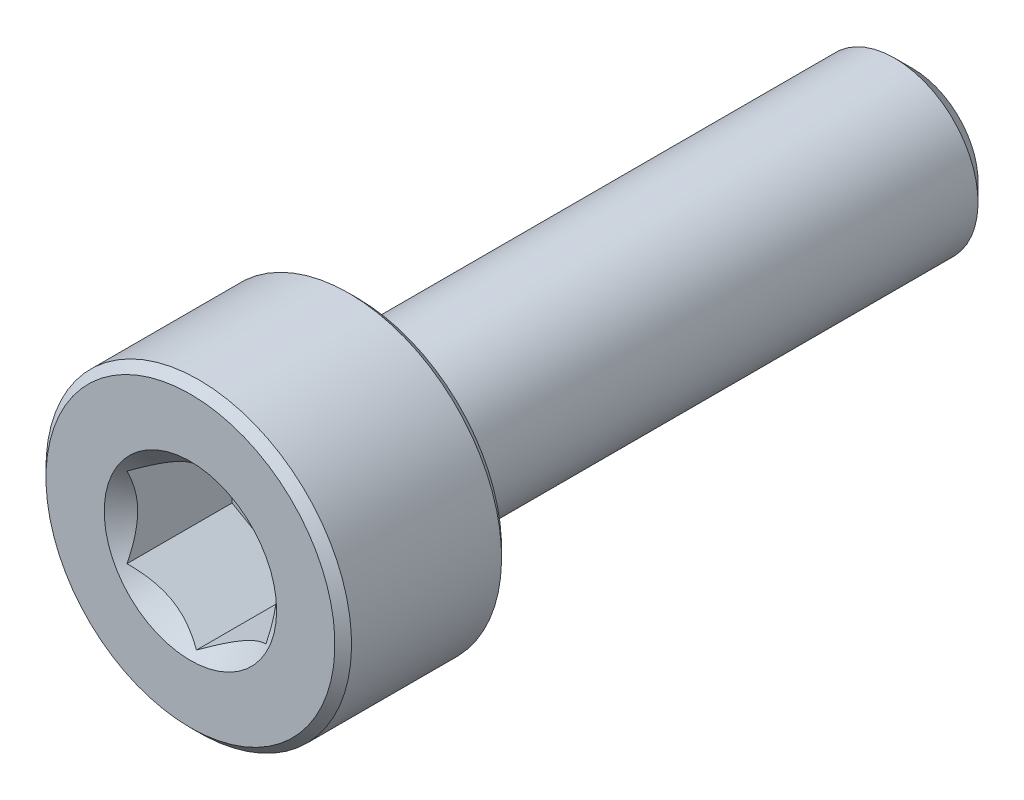
ISO-10303-21;
HEADER;
FILE_DESCRIPTION(('STEP AP214'),'2;1');
FILE_NAME('part.step','',(''),(''),'','','');
FILE_SCHEMA(('AUTOMOTIVE_DESIGN { 1 0 10303 214 1 1 1 1 }'));
ENDSEC;
DATA;
#1=APPLICATION_CONTEXT('core data for automotive mechanical design processes');
#2=APPLICATION_PROTOCOL_DEFINITION('international standard','automotive_design',2000,#1);
#3=PRODUCT_CONTEXT('',#1,'mechanical');
#4=PRODUCT('Part','Part','',(#3));
#5=PRODUCT_RELATED_PRODUCT_CATEGORY('part','',(#4));
#6=PRODUCT_DEFINITION_FORMATION('','',#4);
#7=PRODUCT_DEFINITION_CONTEXT('part definition',#1,'design');
#8=PRODUCT_DEFINITION('design','',#6,#7);
#9=PRODUCT_DEFINITION_SHAPE('','',#8);
#10=(LENGTH_UNIT() NAMED_UNIT(*) SI_UNIT(.MILLI.,.METRE.));
#11=(NAMED_UNIT(*) PLANE_ANGLE_UNIT() SI_UNIT($,.RADIAN.));
#12=(NAMED_UNIT(*) SI_UNIT($,.STERADIAN.) SOLID_ANGLE_UNIT());
#13=UNCERTAINTY_MEASURE_WITH_UNIT(LENGTH_MEASURE(1.E-05),#10,'distance_accuracy_value','');
#14=(GEOMETRIC_REPRESENTATION_CONTEXT(3) GLOBAL_UNCERTAINTY_ASSIGNED_CONTEXT((#13)) GLOBAL_UNIT_ASSIGNED_CONTEXT((#10,
#11,#12)) REPRESENTATION_CONTEXT('',''));
#15=CARTESIAN_POINT('',(0.,0.,0.));
#16=DIRECTION('',(0.,0.,1.));
#17=DIRECTION('',(1.,0.,0.));
#18=AXIS2_PLACEMENT_3D('',#15,#16,#17);
#19=CARTESIAN_POINT('',(0.,0.,3.35));
#20=DIRECTION('',(0.,0.,-1.));
#21=DIRECTION('',(0.,1.,0.));
#22=AXIS2_PLACEMENT_3D('',#19,#20,#21);
#23=TOROIDAL_SURFACE('',#22,1.65,0.15);
#24=CARTESIAN_POINT('',(0.,0.,3.5));
#25=DIRECTION('',(0.,0.,-1.));
#26=DIRECTION('',(0.,1.,0.));
#27=AXIS2_PLACEMENT_3D('',#24,#25,#26);
#28=CIRCLE('',#27,1.65);
#29=CARTESIAN_POINT('',(0.,1.65,3.5));
#30=VERTEX_POINT('',#29);
#31=EDGE_CURVE('E245',#30,#30,#28,.T.);
#32=ORIENTED_EDGE('',*,*,#31,.T.);
#33=EDGE_LOOP('',(#32));
#34=FACE_BOUND('',#33,.T.);
#35=CARTESIAN_POINT('',(0.,0.,3.35));
#36=DIRECTION('',(0.,0.,-1.));
#37=DIRECTION('',(0.,1.,0.));
#38=AXIS2_PLACEMENT_3D('',#35,#36,#37);
#39=CIRCLE('',#38,1.5);
#40=CARTESIAN_POINT('',(0.,1.5,3.35));
#41=VERTEX_POINT('',#40);
#42=EDGE_CURVE('E53',#41,#41,#39,.T.);
#43=ORIENTED_EDGE('',*,*,#42,.F.);
#44=EDGE_LOOP('',(#43));
#45=FACE_BOUND('',#44,.T.);
#46=ADVANCED_FACE('F48',(#34,#45),#23,.F.);
#47=CARTESIAN_POINT('',(0.,2.6,3.5));
#48=DIRECTION('',(0.,0.,-1.));
#49=DIRECTION('',(0.,1.,0.));
#50=AXIS2_PLACEMENT_3D('',#47,#48,#49);
#51=PLANE('',#50);
#52=CARTESIAN_POINT('',(0.,0.,3.5));
#53=DIRECTION('',(0.,0.,-1.));
#54=DIRECTION('',(0.,1.,0.));
#55=AXIS2_PLACEMENT_3D('',#52,#53,#54);
#56=CIRCLE('',#55,2.6);
#57=CARTESIAN_POINT('',(0.,2.6,3.5));
#58=VERTEX_POINT('',#57);
#59=EDGE_CURVE('E247',#58,#58,#56,.T.);
#60=ORIENTED_EDGE('',*,*,#59,.T.);
#61=EDGE_LOOP('',(#60));
#62=FACE_BOUND('',#61,.T.);
#63=ORIENTED_EDGE('',*,*,#31,.F.);
#64=EDGE_LOOP('',(#63));
#65=FACE_BOUND('',#64,.T.);
#66=ADVANCED_FACE('F115',(#62,#65),#51,.T.);
#67=CARTESIAN_POINT('',(0.,0.,3.5));
#68=DIRECTION('',(0.,0.,1.));
#69=DIRECTION('',(0.,-1.,0.));
#70=AXIS2_PLACEMENT_3D('',#67,#68,#69);
#71=CONICAL_SURFACE('',#70,2.6,0.785398163397445);
#72=CARTESIAN_POINT('',(0.,0.,3.65));
#73=DIRECTION('',(0.,0.,-1.));
#74=DIRECTION('',(0.,1.,0.));
#75=AXIS2_PLACEMENT_3D('',#72,#73,#74);
#76=CIRCLE('',#75,2.75);
#77=CARTESIAN_POINT('',(0.,2.75,3.65));
#78=VERTEX_POINT('',#77);
#79=EDGE_CURVE('E256',#78,#78,#76,.T.);
#80=ORIENTED_EDGE('',*,*,#79,.T.);
#81=EDGE_LOOP('',(#80));
#82=FACE_BOUND('',#81,.T.);
#83=ORIENTED_EDGE('',*,*,#59,.F.);
#84=EDGE_LOOP('',(#83));
#85=FACE_BOUND('',#84,.T.);
#86=ADVANCED_FACE('F120',(#82,#85),#71,.T.);
#87=CARTESIAN_POINT('',(0.,0.,-6.5));
#88=DIRECTION('',(0.,0.,-1.));
#89=DIRECTION('',(0.,1.,0.));
#90=AXIS2_PLACEMENT_3D('',#87,#88,#89);
#91=CYLINDRICAL_SURFACE('',#90,2.75);
#92=CARTESIAN_POINT('',(0.,0.,6.35));
#93=DIRECTION('',(0.,0.,-1.));
#94=DIRECTION('',(0.,1.,0.));
#95=AXIS2_PLACEMENT_3D('',#92,#93,#94);
#96=CIRCLE('',#95,2.75);
#97=CARTESIAN_POINT('',(0.,2.75,6.35));
#98=VERTEX_POINT('',#97);
#99=EDGE_CURVE('E235',#98,#98,#96,.T.);
#100=ORIENTED_EDGE('',*,*,#99,.T.);
#101=EDGE_LOOP('',(#100));
#102=FACE_BOUND('',#101,.T.);
#103=ORIENTED_EDGE('',*,*,#79,.F.);
#104=EDGE_LOOP('',(#103));
#105=FACE_BOUND('',#104,.T.);
#106=ADVANCED_FACE('F128',(#102,#105),#91,.T.);
#107=CARTESIAN_POINT('',(0.,0.,6.35));
#108=DIRECTION('',(0.,0.,-1.));
#109=DIRECTION('',(0.,1.,0.));
#110=AXIS2_PLACEMENT_3D('',#107,#108,#109);
#111=CONICAL_SURFACE('',#110,2.75,0.785398163397451);
#112=CARTESIAN_POINT('',(0.,0.,6.5));
#113=DIRECTION('',(0.,0.,-1.));
#114=DIRECTION('',(0.,1.,0.));
#115=AXIS2_PLACEMENT_3D('',#112,#113,#114);
#116=CIRCLE('',#115,2.6);
#117=CARTESIAN_POINT('',(0.,2.6,6.5));
#118=VERTEX_POINT('',#117);
#119=EDGE_CURVE('E232',#118,#118,#116,.T.);
#120=ORIENTED_EDGE('',*,*,#119,.T.);
#121=EDGE_LOOP('',(#120));
#122=FACE_BOUND('',#121,.T.);
#123=ORIENTED_EDGE('',*,*,#99,.F.);
#124=EDGE_LOOP('',(#123));
#125=FACE_BOUND('',#124,.T.);
#126=ADVANCED_FACE('F132',(#122,#125),#111,.T.);
#127=CARTESIAN_POINT('',(0.,0.,6.5));
#128=DIRECTION('',(0.,0.,1.));
#129=DIRECTION('',(0.,-1.,0.));
#130=AXIS2_PLACEMENT_3D('',#127,#128,#129);
#131=PLANE('',#130);
#132=CARTESIAN_POINT('',(0.,0.,6.5));
#133=DIRECTION('',(0.,0.,1.));
#134=DIRECTION('',(1.,0.,0.));
#135=AXIS2_PLACEMENT_3D('',#132,#133,#134);
#136=CIRCLE('',#135,1.55162884844712);
#137=CARTESIAN_POINT('',(1.55162884844712,0.,6.5));
#138=VERTEX_POINT('',#137);
#139=EDGE_CURVE('E12',#138,#138,#136,.T.);
#140=ORIENTED_EDGE('',*,*,#139,.F.);
#141=EDGE_LOOP('',(#140));
#142=FACE_BOUND('',#141,.T.);
#143=ORIENTED_EDGE('',*,*,#119,.F.);
#144=EDGE_LOOP('',(#143));
#145=FACE_BOUND('',#144,.T.);
#146=ADVANCED_FACE('F136',(#142,#145),#131,.T.);
#147=CARTESIAN_POINT('',(0.,0.,6.5));
#148=DIRECTION('',(0.,0.,1.));
#149=DIRECTION('',(1.,0.,0.));
#150=AXIS2_PLACEMENT_3D('',#147,#148,#149);
#151=CONICAL_SURFACE('',#150,1.55162884844712,0.78539816339745);
#152=ORIENTED_EDGE('',*,*,#139,.T.);
#153=EDGE_LOOP('',(#152));
#154=FACE_BOUND('',#153,.T.);
#155=CARTESIAN_POINT('',(-0.000199999999999347,-1.4434911430279,6.39186230843608));
#156=CARTESIAN_POINT('',(0.0427751670715874,-1.41867941875065,6.36706849258205));
#157=CARTESIAN_POINT('',(0.0864690047459488,-1.39345276980743,6.34373055894563));
#158=CARTESIAN_POINT('',(0.175565930841943,-1.34201263554194,6.30099882861148));
#159=CARTESIAN_POINT('',(0.220977498357065,-1.31579425481276,6.28162881688736));
#160=CARTESIAN_POINT('',(0.312547820935261,-1.26292610442246,6.24844730794042));
#161=CARTESIAN_POINT('',(0.358683240175886,-1.23628980770471,6.2345523835796));
#162=CARTESIAN_POINT('',(0.451970080407593,-1.18243062538508,6.21314410668758));
#163=CARTESIAN_POINT('',(0.499118649136381,-1.15520938653761,6.20561476609373));
#164=CARTESIAN_POINT('',(0.580373556887253,-1.10829684367467,6.19882132257765));
#165=CARTESIAN_POINT('',(0.614374876627942,-1.08866617256958,6.1978153836313));
#166=CARTESIAN_POINT('',(0.682317764432479,-1.04943932800611,6.19950823943826));
#167=CARTESIAN_POINT('',(0.716259317655659,-1.02984316311599,6.20220785174248));
#168=CARTESIAN_POINT('',(0.783814856457501,-0.990839954603499,6.21115575484332));
#169=CARTESIAN_POINT('',(0.817428507286776,-0.971433104248771,6.21740735042665));
#170=CARTESIAN_POINT('',(0.884094638217814,-0.932943395609905,6.23312250594085));
#171=CARTESIAN_POINT('',(0.917146871030297,-0.9138606800983,6.2425874446144));
#172=CARTESIAN_POINT('',(1.00179969160027,-0.864986351354567,6.27067821521453));
#173=CARTESIAN_POINT('',(1.05286649242964,-0.835502920149075,6.29141698197915));
#174=CARTESIAN_POINT('',(1.15300085411326,-0.777690319475908,6.33813395919842));
#175=CARTESIAN_POINT('',(1.20207431157827,-0.749357745598417,6.36409512047371));
#176=CARTESIAN_POINT('',(1.2502,-0.721572366433194,6.39186230843608));
#177=B_SPLINE_CURVE_WITH_KNOTS('',3,(#155,#156,#157,#158,#159,#160,#161,#162,#163,#164,#165,
#166,#167,#168,#169,#170,#171,#172,#173,#174,#175,#176),.UNSPECIFIED.,.F.,.F.,(4,2,2,2,2,2,2,2,
2,2,4),(0.,0.166533409618304,0.334037607289762,0.498880396489698,0.663307919240275,
0.780963963458827,0.898645970148454,1.01643764860773,1.1342799317155,1.32148652032141,
1.50809158792573),.UNSPECIFIED.);
#178=CARTESIAN_POINT('',(0.,-1.44337567297406,6.39174682452695));
#179=VERTEX_POINT('',#178);
#180=CARTESIAN_POINT('',(1.25,-0.721687836487032,6.39174682452694));
#181=VERTEX_POINT('',#180);
#182=EDGE_CURVE('E65',#179,#181,#177,.T.);
#183=ORIENTED_EDGE('',*,*,#182,.F.);
#184=CARTESIAN_POINT('',(-1.2502,-0.721572366433195,6.39186230843608));
#185=CARTESIAN_POINT('',(-1.20722483292841,-0.746384090710444,6.36706849258205));
#186=CARTESIAN_POINT('',(-1.16353099525405,-0.771610739653664,6.34373055894563));
#187=CARTESIAN_POINT('',(-1.07443406915806,-0.823050873919155,6.30099882861148));
#188=CARTESIAN_POINT('',(-1.02902250164294,-0.849269254648333,6.28162881688736));
#189=CARTESIAN_POINT('',(-0.93745217906474,-0.902137405038635,6.24844730794042));
#190=CARTESIAN_POINT('',(-0.891316759824114,-0.928773701756387,6.2345523835796));
#191=CARTESIAN_POINT('',(-0.798029919592408,-0.982632884076012,6.21314410668758));
#192=CARTESIAN_POINT('',(-0.75088135086362,-1.00985412292348,6.20561476609373));
#193=CARTESIAN_POINT('',(-0.669626443112748,-1.05676666578643,6.19882132257765));
#194=CARTESIAN_POINT('',(-0.635625123372059,-1.07639733689152,6.1978153836313));
#195=CARTESIAN_POINT('',(-0.567682235567523,-1.11562418145499,6.19950823943826));
#196=CARTESIAN_POINT('',(-0.533740682344343,-1.1352203463451,6.20220785174248));
#197=CARTESIAN_POINT('',(-0.466185143542501,-1.1742235548576,6.21115575484332));
#198=CARTESIAN_POINT('',(-0.432571492713225,-1.19363040521233,6.21740735042665));
#199=CARTESIAN_POINT('',(-0.365905361782187,-1.23212011385119,6.23312250594085));
#200=CARTESIAN_POINT('',(-0.332853128969705,-1.2512028293628,6.2425874446144));
#201=CARTESIAN_POINT('',(-0.248200308399736,-1.30007715810653,6.27067821521453));
#202=CARTESIAN_POINT('',(-0.197133507570362,-1.32956058931202,6.29141698197915));
#203=CARTESIAN_POINT('',(-0.0969991458867446,-1.38737318998519,6.33813395919842));
#204=CARTESIAN_POINT('',(-0.0479256884217298,-1.41570576386268,6.36409512047371));
#205=CARTESIAN_POINT('',(0.000200000000000719,-1.4434911430279,6.39186230843608));
#206=B_SPLINE_CURVE_WITH_KNOTS('',3,(#184,#185,#186,#187,#188,#189,#190,#191,#192,#193,#194,
#195,#196,#197,#198,#199,#200,#201,#202,#203,#204,#205),.UNSPECIFIED.,.F.,.F.,(4,2,2,2,2,2,2,2,
2,2,4),(0.,0.166533409618303,0.334037607289761,0.498880396489698,0.663307919240274,
0.780963963458826,0.898645970148452,1.01643764860773,1.13427993171549,1.32148652032141,
1.50809158792574),.UNSPECIFIED.);
#207=CARTESIAN_POINT('',(-1.25,-0.721687836487032,6.39174682452694));
#208=VERTEX_POINT('',#207);
#209=EDGE_CURVE('E58',#208,#179,#206,.T.);
#210=ORIENTED_EDGE('',*,*,#209,.F.);
#211=CARTESIAN_POINT('',(-1.25,-1.52022146239345,6.91651070319084));
#212=CARTESIAN_POINT('',(-1.25,-1.48354689134962,6.88818689718723));
#213=CARTESIAN_POINT('',(-1.25,-1.44667707589305,6.86011672093047));
#214=CARTESIAN_POINT('',(-1.25,-1.37246477804769,6.80459065501776));
#215=CARTESIAN_POINT('',(-1.25,-1.33512218721453,6.77713491044787));
#216=CARTESIAN_POINT('',(-1.25,-1.22171630832114,6.69545809771049));
#217=CARTESIAN_POINT('',(-1.25,-1.14482995781092,6.6423614251193));
#218=CARTESIAN_POINT('',(-1.25,-0.983056768942587,6.53734973416941));
#219=CARTESIAN_POINT('',(-1.25,-0.897974111811057,6.48573326925832));
#220=CARTESIAN_POINT('',(-1.25,-0.723462355215556,6.39078355108508));
#221=CARTESIAN_POINT('',(-1.25,-0.634049271919706,6.34742232185916));
#222=CARTESIAN_POINT('',(-1.25,-0.5005887711437,6.29435177040724));
#223=CARTESIAN_POINT('',(-1.25,-0.45869172620811,6.27926501327173));
#224=CARTESIAN_POINT('',(-1.25,-0.373815329706779,6.25244749770266));
#225=CARTESIAN_POINT('',(-1.25,-0.330835910419723,6.24071694982871));
#226=CARTESIAN_POINT('',(-1.25,-0.244810833071148,6.22144313304601));
#227=CARTESIAN_POINT('',(-1.25,-0.20178270746757,6.21382289169453));
#228=CARTESIAN_POINT('',(-1.25,-0.115176247984995,6.20293190707962));
#229=CARTESIAN_POINT('',(-1.25,-0.0715980347745597,6.1996602260857));
#230=CARTESIAN_POINT('',(-1.25,0.0136806197531966,6.19775210045869));
#231=CARTESIAN_POINT('',(-1.25,0.0553765370047047,6.19891205716704));
#232=CARTESIAN_POINT('',(-1.25,0.13844909645316,6.20533266388464));
#233=CARTESIAN_POINT('',(-1.25,0.179825709781942,6.21059368038276));
#234=CARTESIAN_POINT('',(-1.25,0.262662840763598,6.22500574721218));
#235=CARTESIAN_POINT('',(-1.25,0.304111120669651,6.23422600730023));
#236=CARTESIAN_POINT('',(-1.25,0.386089884230834,6.25604235623938));
#237=CARTESIAN_POINT('',(-1.25,0.426620414510369,6.26863827317792));
#238=CARTESIAN_POINT('',(-1.25,0.550794781768362,6.3120595916479));
#239=CARTESIAN_POINT('',(-1.25,0.632755591043412,6.34768282700966));
#240=CARTESIAN_POINT('',(-1.25,0.792852508946382,6.42696814455953));
#241=CARTESIAN_POINT('',(-1.25,0.870973935410876,6.47065844211049));
#242=CARTESIAN_POINT('',(-1.25,1.02031328199646,6.56088158787621));
#243=CARTESIAN_POINT('',(-1.25,1.09168171050215,6.60716845879521));
#244=CARTESIAN_POINT('',(-1.25,1.19682802849918,6.67876149953674));
#245=CARTESIAN_POINT('',(-1.25,1.2314248214359,6.70288582787532));
#246=CARTESIAN_POINT('',(-1.25,1.30014350643268,6.75178258410313));
#247=CARTESIAN_POINT('',(-1.25,1.33426552680451,6.7765548314612));
#248=CARTESIAN_POINT('',(-1.25,1.36818950249276,6.8015960474388));
#249=B_SPLINE_CURVE_WITH_KNOTS('',3,(#211,#212,#213,#214,#215,#216,#217,#218,#219,#220,#221,
#222,#223,#224,#225,#226,#227,#228,#229,#230,#231,#232,#233,#234,#235,#236,#237,#238,#239,#240,
#241,#242,#243,#244,#245,#246,#247,#248),.UNSPECIFIED.,.F.,.F.,(4,2,2,2,2,2,2,2,2,2,2,2,2,2,2,2,
2,2,4),(0.,0.139012369615044,0.278057225136918,0.558259504053771,0.856585057342475,
1.15388088887299,1.28736138903992,1.42085026158167,1.55174393609413,1.68260937990424,
1.80753647715252,1.93247473971975,2.05969207441603,2.18690293152764,2.45422704655832,
2.72250450232039,2.97756898823762,3.10409578574714,3.23058769667827),.UNSPECIFIED.);
#250=CARTESIAN_POINT('',(-1.25,0.721687836487032,6.39174682452694));
#251=VERTEX_POINT('',#250);
#252=EDGE_CURVE('E174',#251,#208,#249,.F.);
#253=ORIENTED_EDGE('',*,*,#252,.F.);
#254=CARTESIAN_POINT('',(0.000199999999999644,1.4434911430279,6.39186230843608));
#255=CARTESIAN_POINT('',(-0.0427751670715868,1.41867941875065,6.36706849258205));
#256=CARTESIAN_POINT('',(-0.0864690047459481,1.39345276980743,6.34373055894563));
#257=CARTESIAN_POINT('',(-0.175565930841942,1.34201263554194,6.30099882861148));
#258=CARTESIAN_POINT('',(-0.220977498357064,1.31579425481276,6.28162881688736));
#259=CARTESIAN_POINT('',(-0.312547820935259,1.26292610442246,6.24844730794042));
#260=CARTESIAN_POINT('',(-0.358683240175885,1.23628980770471,6.2345523835796));
#261=CARTESIAN_POINT('',(-0.451970080407592,1.18243062538508,6.21314410668758));
#262=CARTESIAN_POINT('',(-0.49911864913638,1.15520938653761,6.20561476609373));
#263=CARTESIAN_POINT('',(-0.580373556887252,1.10829684367467,6.19882132257765));
#264=CARTESIAN_POINT('',(-0.614374876627941,1.08866617256958,6.1978153836313));
#265=CARTESIAN_POINT('',(-0.682317764432477,1.04943932800611,6.19950823943826));
#266=CARTESIAN_POINT('',(-0.716259317655657,1.02984316311599,6.20220785174248));
#267=CARTESIAN_POINT('',(-0.783814856457499,0.990839954603499,6.21115575484332));
#268=CARTESIAN_POINT('',(-0.817428507286774,0.971433104248771,6.21740735042665));
#269=CARTESIAN_POINT('',(-0.884094638217813,0.932943395609905,6.23312250594085));
#270=CARTESIAN_POINT('',(-0.917146871030295,0.9138606800983,6.2425874446144));
#271=CARTESIAN_POINT('',(-1.00179969160026,0.864986351354567,6.27067821521453));
#272=CARTESIAN_POINT('',(-1.05286649242964,0.835502920149075,6.29141698197915));
#273=CARTESIAN_POINT('',(-1.15300085411325,0.777690319475908,6.33813395919842));
#274=CARTESIAN_POINT('',(-1.20207431157827,0.749357745598416,6.36409512047371));
#275=CARTESIAN_POINT('',(-1.2502,0.721572366433194,6.39186230843608));
#276=B_SPLINE_CURVE_WITH_KNOTS('',3,(#254,#255,#256,#257,#258,#259,#260,#261,#262,#263,#264,
#265,#266,#267,#268,#269,#270,#271,#272,#273,#274,#275),.UNSPECIFIED.,.F.,.F.,(4,2,2,2,2,2,2,2,
2,2,4),(0.,0.166533409618303,0.334037607289761,0.498880396489697,0.663307919240274,
0.780963963458826,0.898645970148452,1.01643764860773,1.13427993171549,1.32148652032141,
1.50809158792574),.UNSPECIFIED.);
#277=CARTESIAN_POINT('',(0.,1.44337567297406,6.39174682452694));
#278=VERTEX_POINT('',#277);
#279=EDGE_CURVE('E167',#278,#251,#276,.T.);
#280=ORIENTED_EDGE('',*,*,#279,.F.);
#281=CARTESIAN_POINT('',(1.2502,0.721572366433194,6.39186230843608));
#282=CARTESIAN_POINT('',(1.20722483292841,0.746384090710444,6.36706849258205));
#283=CARTESIAN_POINT('',(1.16353099525405,0.771610739653664,6.34373055894563));
#284=CARTESIAN_POINT('',(1.07443406915806,0.823050873919154,6.30099882861148));
#285=CARTESIAN_POINT('',(1.02902250164294,0.849269254648333,6.28162881688736));
#286=CARTESIAN_POINT('',(0.93745217906474,0.902137405038635,6.24844730794042));
#287=CARTESIAN_POINT('',(0.891316759824114,0.928773701756387,6.2345523835796));
#288=CARTESIAN_POINT('',(0.798029919592408,0.982632884076012,6.21314410668758));
#289=CARTESIAN_POINT('',(0.750881350863621,1.00985412292348,6.20561476609373));
#290=CARTESIAN_POINT('',(0.669626443112748,1.05676666578643,6.19882132257765));
#291=CARTESIAN_POINT('',(0.635625123372059,1.07639733689152,6.19781538363129));
#292=CARTESIAN_POINT('',(0.567682235567523,1.11562418145499,6.19950823943826));
#293=CARTESIAN_POINT('',(0.533740682344343,1.1352203463451,6.20220785174248));
#294=CARTESIAN_POINT('',(0.466185143542501,1.1742235548576,6.21115575484332));
#295=CARTESIAN_POINT('',(0.432571492713226,1.19363040521233,6.21740735042665));
#296=CARTESIAN_POINT('',(0.365905361782187,1.23212011385119,6.23312250594085));
#297=CARTESIAN_POINT('',(0.332853128969705,1.2512028293628,6.2425874446144));
#298=CARTESIAN_POINT('',(0.248200308399736,1.30007715810653,6.27067821521453));
#299=CARTESIAN_POINT('',(0.197133507570362,1.32956058931202,6.29141698197915));
#300=CARTESIAN_POINT('',(0.0969991458867456,1.38737318998519,6.33813395919842));
#301=CARTESIAN_POINT('',(0.0479256884217306,1.41570576386268,6.36409512047371));
#302=CARTESIAN_POINT('',(-0.000200000000000208,1.4434911430279,6.39186230843608));
#303=B_SPLINE_CURVE_WITH_KNOTS('',3,(#281,#282,#283,#284,#285,#286,#287,#288,#289,#290,#291,
#292,#293,#294,#295,#296,#297,#298,#299,#300,#301,#302),.UNSPECIFIED.,.F.,.F.,(4,2,2,2,2,2,2,2,
2,2,4),(0.,0.166533409618303,0.334037607289761,0.498880396489698,0.663307919240274,
0.780963963458826,0.898645970148452,1.01643764860773,1.13427993171549,1.32148652032141,
1.50809158792574),.UNSPECIFIED.);
#304=CARTESIAN_POINT('',(1.25,0.721687836487032,6.39174682452694));
#305=VERTEX_POINT('',#304);
#306=EDGE_CURVE('E158',#305,#278,#303,.T.);
#307=ORIENTED_EDGE('',*,*,#306,.F.);
#308=CARTESIAN_POINT('',(1.25,-1.52022146239345,6.91651070319084));
#309=CARTESIAN_POINT('',(1.25,-1.48354689134962,6.88818689718723));
#310=CARTESIAN_POINT('',(1.25,-1.44667707589305,6.86011672093047));
#311=CARTESIAN_POINT('',(1.25,-1.37246477804769,6.80459065501776));
#312=CARTESIAN_POINT('',(1.25,-1.33512218721453,6.77713491044787));
#313=CARTESIAN_POINT('',(1.25,-1.22171630832114,6.69545809771049));
#314=CARTESIAN_POINT('',(1.25,-1.14482995781092,6.6423614251193));
#315=CARTESIAN_POINT('',(1.25,-0.983056768942587,6.53734973416941));
#316=CARTESIAN_POINT('',(1.25,-0.897974111811057,6.48573326925832));
#317=CARTESIAN_POINT('',(1.25,-0.723462355215556,6.39078355108508));
#318=CARTESIAN_POINT('',(1.25,-0.634049271919706,6.34742232185916));
#319=CARTESIAN_POINT('',(1.25,-0.500588771143699,6.29435177040724));
#320=CARTESIAN_POINT('',(1.25,-0.45869172620811,6.27926501327173));
#321=CARTESIAN_POINT('',(1.25,-0.373815329706778,6.25244749770266));
#322=CARTESIAN_POINT('',(1.25,-0.330835910419723,6.24071694982871));
#323=CARTESIAN_POINT('',(1.25,-0.244810833071148,6.22144313304601));
#324=CARTESIAN_POINT('',(1.25,-0.20178270746757,6.21382289169453));
#325=CARTESIAN_POINT('',(1.25,-0.115176247984995,6.20293190707962));
#326=CARTESIAN_POINT('',(1.25,-0.0715980347745598,6.1996602260857));
#327=CARTESIAN_POINT('',(1.25,0.0136806197531965,6.19775210045869));
#328=CARTESIAN_POINT('',(1.25,0.0553765370047047,6.19891205716704));
#329=CARTESIAN_POINT('',(1.25,0.13844909645316,6.20533266388464));
#330=CARTESIAN_POINT('',(1.25,0.179825709781942,6.21059368038276));
#331=CARTESIAN_POINT('',(1.25,0.262662840763599,6.22500574721218));
#332=CARTESIAN_POINT('',(1.25,0.304111120669651,6.23422600730023));
#333=CARTESIAN_POINT('',(1.25,0.386089884230835,6.25604235623938));
#334=CARTESIAN_POINT('',(1.25,0.426620414510369,6.26863827317792));
#335=CARTESIAN_POINT('',(1.25,0.550794781768362,6.31205959164791));
#336=CARTESIAN_POINT('',(1.25,0.632755591043412,6.34768282700966));
#337=CARTESIAN_POINT('',(1.25,0.792852508946383,6.42696814455953));
#338=CARTESIAN_POINT('',(1.25,0.870973935410876,6.47065844211049));
#339=CARTESIAN_POINT('',(1.25,1.02031328199646,6.56088158787621));
#340=CARTESIAN_POINT('',(1.25,1.09168171050215,6.60716845879521));
#341=CARTESIAN_POINT('',(1.25,1.19682802849918,6.67876149953674));
#342=CARTESIAN_POINT('',(1.25,1.2314248214359,6.70288582787532));
#343=CARTESIAN_POINT('',(1.25,1.30014350643268,6.75178258410313));
#344=CARTESIAN_POINT('',(1.25,1.33426552680451,6.7765548314612));
#345=CARTESIAN_POINT('',(1.25,1.36818950249276,6.8015960474388));
#346=B_SPLINE_CURVE_WITH_KNOTS('',3,(#308,#309,#310,#311,#312,#313,#314,#315,#316,#317,#318,
#319,#320,#321,#322,#323,#324,#325,#326,#327,#328,#329,#330,#331,#332,#333,#334,#335,#336,#337,
#338,#339,#340,#341,#342,#343,#344,#345),.UNSPECIFIED.,.F.,.F.,(4,2,2,2,2,2,2,2,2,2,2,2,2,2,2,2,
2,2,4),(0.,0.139012369615044,0.278057225136918,0.558259504053771,0.856585057342474,
1.15388088887299,1.28736138903992,1.42085026158167,1.55174393609413,1.68260937990424,
1.80753647715252,1.93247473971975,2.05969207441603,2.18690293152764,2.45422704655832,
2.72250450232039,2.97756898823762,3.10409578574714,3.23058769667827),.UNSPECIFIED.);
#347=EDGE_CURVE('E150',#181,#305,#346,.T.);
#348=ORIENTED_EDGE('',*,*,#347,.F.);
#349=EDGE_LOOP('',(#183,#210,#253,#280,#307,#348));
#350=FACE_BOUND('',#349,.T.);
#351=ADVANCED_FACE('F50',(#154,#350),#151,.F.);
#352=CARTESIAN_POINT('',(0.,2.6,4.5));
#353=DIRECTION('',(0.,0.,-1.));
#354=DIRECTION('',(0.,1.,0.));
#355=AXIS2_PLACEMENT_3D('',#352,#353,#354);
#356=PLANE('',#355);
#357=DIRECTION('',(0.866025403784438,0.5,0.));
#358=VECTOR('',#357,1.);
#359=CARTESIAN_POINT('',(0.,-1.44337567297406,4.5));
#360=LINE('',#359,#358);
#361=CARTESIAN_POINT('',(0.,-1.44337567297406,4.5));
#362=VERTEX_POINT('',#361);
#363=CARTESIAN_POINT('',(1.25,-0.721687836487032,4.5));
#364=VERTEX_POINT('',#363);
#365=EDGE_CURVE('E219',#362,#364,#360,.T.);
#366=ORIENTED_EDGE('',*,*,#365,.T.);
#367=DIRECTION('',(0.,1.,0.));
#368=VECTOR('',#367,1.);
#369=CARTESIAN_POINT('',(1.25,-0.721687836487032,4.5));
#370=LINE('',#369,#368);
#371=CARTESIAN_POINT('',(1.25,0.721687836487032,4.5));
#372=VERTEX_POINT('',#371);
#373=EDGE_CURVE('E159',#364,#372,#370,.T.);
#374=ORIENTED_EDGE('',*,*,#373,.T.);
#375=DIRECTION('',(-0.866025403784439,0.5,0.));
#376=VECTOR('',#375,1.);
#377=CARTESIAN_POINT('',(1.25,0.721687836487032,4.5));
#378=LINE('',#377,#376);
#379=CARTESIAN_POINT('',(0.,1.44337567297406,4.5));
#380=VERTEX_POINT('',#379);
#381=EDGE_CURVE('E220',#372,#380,#378,.T.);
#382=ORIENTED_EDGE('',*,*,#381,.T.);
#383=DIRECTION('',(-0.866025403784439,-0.5,0.));
#384=VECTOR('',#383,1.);
#385=CARTESIAN_POINT('',(0.,1.44337567297406,4.5));
#386=LINE('',#385,#384);
#387=CARTESIAN_POINT('',(-1.25,0.721687836487032,4.5));
#388=VERTEX_POINT('',#387);
#389=EDGE_CURVE('E225',#380,#388,#386,.T.);
#390=ORIENTED_EDGE('',*,*,#389,.T.);
#391=DIRECTION('',(0.,-1.,0.));
#392=VECTOR('',#391,1.);
#393=CARTESIAN_POINT('',(-1.25,0.721687836487032,4.5));
#394=LINE('',#393,#392);
#395=CARTESIAN_POINT('',(-1.25,-0.721687836487033,4.5));
#396=VERTEX_POINT('',#395);
#397=EDGE_CURVE('E210',#388,#396,#394,.T.);
#398=ORIENTED_EDGE('',*,*,#397,.T.);
#399=DIRECTION('',(0.866025403784439,-0.5,0.));
#400=VECTOR('',#399,1.);
#401=CARTESIAN_POINT('',(-1.25,-0.721687836487032,4.5));
#402=LINE('',#401,#400);
#403=EDGE_CURVE('E209',#396,#362,#402,.T.);
#404=ORIENTED_EDGE('',*,*,#403,.T.);
#405=EDGE_LOOP('',(#366,#374,#382,#390,#398,#404));
#406=FACE_BOUND('',#405,.T.);
#407=ADVANCED_FACE('F141',(#406),#356,.F.);
#408=CARTESIAN_POINT('',(0.,-1.44337567297406,-0.318813079129867));
#409=DIRECTION('',(0.5,-0.866025403784438,0.));
#410=DIRECTION('',(0.866025403784438,0.5,0.));
#411=AXIS2_PLACEMENT_3D('',#408,#409,#410);
#412=PLANE('',#411);
#413=DIRECTION('',(0.,0.,1.));
#414=VECTOR('',#413,1.);
#415=CARTESIAN_POINT('',(0.,-1.44337567297406,-0.318813079129867));
#416=LINE('',#415,#414);
#417=EDGE_CURVE('E213',#362,#179,#416,.T.);
#418=ORIENTED_EDGE('',*,*,#417,.T.);
#419=ORIENTED_EDGE('',*,*,#182,.T.);
#420=DIRECTION('',(0.,0.,1.));
#421=VECTOR('',#420,1.);
#422=CARTESIAN_POINT('',(1.25,-0.721687836487032,-0.318813079129867));
#423=LINE('',#422,#421);
#424=EDGE_CURVE('E228',#364,#181,#423,.T.);
#425=ORIENTED_EDGE('',*,*,#424,.F.);
#426=ORIENTED_EDGE('',*,*,#365,.F.);
#427=EDGE_LOOP('',(#418,#419,#425,#426));
#428=FACE_BOUND('',#427,.T.);
#429=ADVANCED_FACE('F143',(#428),#412,.F.);
#430=CARTESIAN_POINT('',(-1.25,-0.721687836487032,-0.318813079129867));
#431=DIRECTION('',(-0.5,-0.866025403784439,0.));
#432=DIRECTION('',(0.866025403784439,-0.5,0.));
#433=AXIS2_PLACEMENT_3D('',#430,#431,#432);
#434=PLANE('',#433);
#435=DIRECTION('',(0.,0.,1.));
#436=VECTOR('',#435,1.);
#437=CARTESIAN_POINT('',(-1.25,-0.721687836487032,-0.318813079129867));
#438=LINE('',#437,#436);
#439=EDGE_CURVE('E204',#396,#208,#438,.T.);
#440=ORIENTED_EDGE('',*,*,#439,.T.);
#441=ORIENTED_EDGE('',*,*,#209,.T.);
#442=ORIENTED_EDGE('',*,*,#417,.F.);
#443=ORIENTED_EDGE('',*,*,#403,.F.);
#444=EDGE_LOOP('',(#440,#441,#442,#443));
#445=FACE_BOUND('',#444,.T.);
#446=ADVANCED_FACE('F189',(#445),#434,.F.);
#447=CARTESIAN_POINT('',(-1.25,0.721687836487032,-0.318813079129867));
#448=DIRECTION('',(-1.,0.,0.));
#449=DIRECTION('',(0.,0.,1.));
#450=AXIS2_PLACEMENT_3D('',#447,#448,#449);
#451=PLANE('',#450);
#452=DIRECTION('',(0.,0.,1.));
#453=VECTOR('',#452,1.);
#454=CARTESIAN_POINT('',(-1.25,0.721687836487032,-0.318813079129867));
#455=LINE('',#454,#453);
#456=EDGE_CURVE('E207',#388,#251,#455,.T.);
#457=ORIENTED_EDGE('',*,*,#456,.T.);
#458=ORIENTED_EDGE('',*,*,#252,.T.);
#459=ORIENTED_EDGE('',*,*,#439,.F.);
#460=ORIENTED_EDGE('',*,*,#397,.F.);
#461=EDGE_LOOP('',(#457,#458,#459,#460));
#462=FACE_BOUND('',#461,.T.);
#463=ADVANCED_FACE('F184',(#462),#451,.F.);
#464=CARTESIAN_POINT('',(0.,1.44337567297406,-0.318813079129867));
#465=DIRECTION('',(-0.5,0.866025403784438,0.));
#466=DIRECTION('',(-0.866025403784439,-0.5,0.));
#467=AXIS2_PLACEMENT_3D('',#464,#465,#466);
#468=PLANE('',#467);
#469=DIRECTION('',(0.,0.,1.));
#470=VECTOR('',#469,1.);
#471=CARTESIAN_POINT('',(0.,1.44337567297406,-0.318813079129867));
#472=LINE('',#471,#470);
#473=EDGE_CURVE('E224',#380,#278,#472,.T.);
#474=ORIENTED_EDGE('',*,*,#473,.T.);
#475=ORIENTED_EDGE('',*,*,#279,.T.);
#476=ORIENTED_EDGE('',*,*,#456,.F.);
#477=ORIENTED_EDGE('',*,*,#389,.F.);
#478=EDGE_LOOP('',(#474,#475,#476,#477));
#479=FACE_BOUND('',#478,.T.);
#480=ADVANCED_FACE('F181',(#479),#468,.F.);
#481=CARTESIAN_POINT('',(1.25,0.721687836487032,-0.318813079129867));
#482=DIRECTION('',(0.5,0.866025403784439,0.));
#483=DIRECTION('',(-0.866025403784439,0.5,0.));
#484=AXIS2_PLACEMENT_3D('',#481,#482,#483);
#485=PLANE('',#484);
#486=DIRECTION('',(0.,0.,1.));
#487=VECTOR('',#486,1.);
#488=CARTESIAN_POINT('',(1.25,0.721687836487032,-0.318813079129867));
#489=LINE('',#488,#487);
#490=EDGE_CURVE('E223',#372,#305,#489,.T.);
#491=ORIENTED_EDGE('',*,*,#490,.T.);
#492=ORIENTED_EDGE('',*,*,#306,.T.);
#493=ORIENTED_EDGE('',*,*,#473,.F.);
#494=ORIENTED_EDGE('',*,*,#381,.F.);
#495=EDGE_LOOP('',(#491,#492,#493,#494));
#496=FACE_BOUND('',#495,.T.);
#497=ADVANCED_FACE('F109',(#496),#485,.F.);
#498=CARTESIAN_POINT('',(1.25,-0.721687836487032,-0.318813079129867));
#499=DIRECTION('',(1.,0.,0.));
#500=DIRECTION('',(0.,0.,-1.));
#501=AXIS2_PLACEMENT_3D('',#498,#499,#500);
#502=PLANE('',#501);
#503=ORIENTED_EDGE('',*,*,#424,.T.);
#504=ORIENTED_EDGE('',*,*,#347,.T.);
#505=ORIENTED_EDGE('',*,*,#490,.F.);
#506=ORIENTED_EDGE('',*,*,#373,.F.);
#507=EDGE_LOOP('',(#503,#504,#505,#506));
#508=FACE_BOUND('',#507,.T.);
#509=ADVANCED_FACE('F103',(#508),#502,.F.);
#510=CARTESIAN_POINT('',(0.,0.,2.48397459621555));
#511=DIRECTION('',(0.,0.,1.));
#512=DIRECTION('',(0.,-1.,0.));
#513=AXIS2_PLACEMENT_3D('',#510,#511,#512);
#514=CONICAL_SURFACE('',#513,0.,1.04719755119659);
#515=ORIENTED_EDGE('',*,*,#42,.T.);
#516=EDGE_LOOP('',(#515));
#517=FACE_BOUND('',#516,.T.);
#518=CARTESIAN_POINT('',(0.,0.,2.48397459621555));
#519=VERTEX_POINT('',#518);
#520=VERTEX_LOOP('',#519);
#521=FACE_BOUND('',#520,.T.);
#522=ADVANCED_FACE('F101',(#517,#521),#514,.T.);
#523=CLOSED_SHELL('',(#46,#66,#86,#106,#126,#146,#351,#407,#429,#446,#463,#480,#497,#509,#522));
#524=MANIFOLD_SOLID_BREP('B2',#523);
#525=CARTESIAN_POINT('',(-2.76,-2.75,3.35));
#526=DIRECTION('',(0.,0.,-1.));
#527=DIRECTION('',(-1.,0.,0.));
#528=AXIS2_PLACEMENT_3D('',#525,#526,#527);
#529=PLANE('',#528);
#530=CARTESIAN_POINT('',(0.,0.,3.35));
#531=DIRECTION('',(0.,0.,-1.));
#532=DIRECTION('',(0.,1.,0.));
#533=AXIS2_PLACEMENT_3D('',#530,#531,#532);
#534=CIRCLE('',#533,1.5);
#535=CARTESIAN_POINT('',(0.,1.5,3.35));
#536=VERTEX_POINT('',#535);
#537=EDGE_CURVE('E352',#536,#536,#534,.T.);
#538=ORIENTED_EDGE('',*,*,#537,.F.);
#539=EDGE_LOOP('',(#538));
#540=FACE_BOUND('',#539,.T.);
#541=ADVANCED_FACE('F342',(#540),#529,.F.);
#542=CARTESIAN_POINT('',(0.,1.17524047358084,-6.5));
#543=DIRECTION('',(0.,0.,-1.));
#544=DIRECTION('',(0.,1.,0.));
#545=AXIS2_PLACEMENT_3D('',#542,#543,#544);
#546=PLANE('',#545);
#547=CARTESIAN_POINT('',(0.,0.,-6.5));
#548=DIRECTION('',(0.,0.,-1.));
#549=DIRECTION('',(0.,1.,0.));
#550=AXIS2_PLACEMENT_3D('',#547,#548,#549);
#551=CIRCLE('',#550,1.17524047358084);
#552=CARTESIAN_POINT('',(0.,1.17524047358084,-6.5));
#553=VERTEX_POINT('',#552);
#554=EDGE_CURVE('E47',#553,#553,#551,.T.);
#555=ORIENTED_EDGE('',*,*,#554,.T.);
#556=EDGE_LOOP('',(#555));
#557=FACE_BOUND('',#556,.T.);
#558=ADVANCED_FACE('F363',(#557),#546,.T.);
#559=CARTESIAN_POINT('',(0.,0.,-6.5));
#560=DIRECTION('',(0.,0.,1.));
#561=DIRECTION('',(0.,-1.,0.));
#562=AXIS2_PLACEMENT_3D('',#559,#560,#561);
#563=CONICAL_SURFACE('',#562,1.17524047358084,0.785398163397444);
#564=CARTESIAN_POINT('',(0.,0.,-6.17524047358083));
#565=DIRECTION('',(0.,0.,-1.));
#566=DIRECTION('',(0.,1.,0.));
#567=AXIS2_PLACEMENT_3D('',#564,#565,#566);
#568=CIRCLE('',#567,1.5);
#569=CARTESIAN_POINT('',(0.,1.5,-6.17524047358083));
#570=VERTEX_POINT('',#569);
#571=EDGE_CURVE('E348',#570,#570,#568,.T.);
#572=ORIENTED_EDGE('',*,*,#571,.T.);
#573=EDGE_LOOP('',(#572));
#574=FACE_BOUND('',#573,.T.);
#575=ORIENTED_EDGE('',*,*,#554,.F.);
#576=EDGE_LOOP('',(#575));
#577=FACE_BOUND('',#576,.T.);
#578=ADVANCED_FACE('F369',(#574,#577),#563,.T.);
#579=CARTESIAN_POINT('',(0.,0.,-6.5));
#580=DIRECTION('',(0.,0.,-1.));
#581=DIRECTION('',(0.,1.,0.));
#582=AXIS2_PLACEMENT_3D('',#579,#580,#581);
#583=CYLINDRICAL_SURFACE('',#582,1.5);
#584=ORIENTED_EDGE('',*,*,#537,.T.);
#585=EDGE_LOOP('',(#584));
#586=FACE_BOUND('',#585,.T.);
#587=ORIENTED_EDGE('',*,*,#571,.F.);
#588=EDGE_LOOP('',(#587));
#589=FACE_BOUND('',#588,.T.);
#590=ADVANCED_FACE('F359',(#586,#589),#583,.T.);
#591=CLOSED_SHELL('',(#541,#558,#578,#590));
#592=MANIFOLD_SOLID_BREP('B6',#591);
#593=ADVANCED_BREP_SHAPE_REPRESENTATION('',(#18,#524,#592),#14);
#594=SHAPE_DEFINITION_REPRESENTATION(#9,#593);
ENDSEC;
END-ISO-10303-21;
